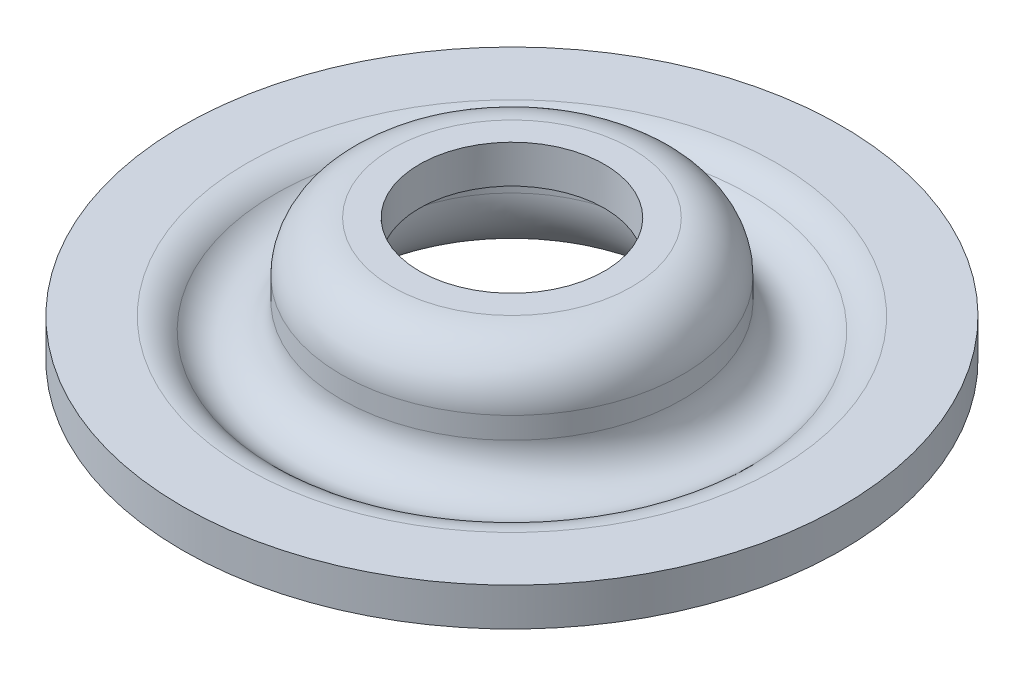
ISO-10303-21;
HEADER;
FILE_DESCRIPTION(('STEP AP214'),'2;1');
FILE_NAME('part.step','',(''),(''),'','','');
FILE_SCHEMA(('AUTOMOTIVE_DESIGN { 1 0 10303 214 1 1 1 1 }'));
ENDSEC;
DATA;
#1=APPLICATION_CONTEXT('core data for automotive mechanical design processes');
#2=APPLICATION_PROTOCOL_DEFINITION('international standard','automotive_design',2000,#1);
#3=PRODUCT_CONTEXT('',#1,'mechanical');
#4=PRODUCT('Part','Part','',(#3));
#5=PRODUCT_RELATED_PRODUCT_CATEGORY('part','',(#4));
#6=PRODUCT_DEFINITION_FORMATION('','',#4);
#7=PRODUCT_DEFINITION_CONTEXT('part definition',#1,'design');
#8=PRODUCT_DEFINITION('design','',#6,#7);
#9=PRODUCT_DEFINITION_SHAPE('','',#8);
#10=(LENGTH_UNIT() NAMED_UNIT(*) SI_UNIT(.MILLI.,.METRE.));
#11=(NAMED_UNIT(*) PLANE_ANGLE_UNIT() SI_UNIT($,.RADIAN.));
#12=(NAMED_UNIT(*) SI_UNIT($,.STERADIAN.) SOLID_ANGLE_UNIT());
#13=UNCERTAINTY_MEASURE_WITH_UNIT(LENGTH_MEASURE(1.E-05),#10,'distance_accuracy_value','');
#14=(GEOMETRIC_REPRESENTATION_CONTEXT(3) GLOBAL_UNCERTAINTY_ASSIGNED_CONTEXT((#13)) GLOBAL_UNIT_ASSIGNED_CONTEXT((#10,
#11,#12)) REPRESENTATION_CONTEXT('',''));
#15=CARTESIAN_POINT('',(0.,0.,0.));
#16=DIRECTION('',(0.,0.,1.));
#17=DIRECTION('',(1.,0.,0.));
#18=AXIS2_PLACEMENT_3D('',#15,#16,#17);
#19=CARTESIAN_POINT('',(0.,55.,0.));
#20=DIRECTION('',(0.,1.,0.));
#21=DIRECTION('',(0.,0.,1.));
#22=AXIS2_PLACEMENT_3D('',#19,#20,#21);
#23=CYLINDRICAL_SURFACE('',#22,26.);
#24=CARTESIAN_POINT('',(0.,1.978,0.));
#25=DIRECTION('',(0.,1.,0.));
#26=DIRECTION('',(0.,0.,1.));
#27=AXIS2_PLACEMENT_3D('',#24,#25,#26);
#28=CIRCLE('',#27,26.);
#29=CARTESIAN_POINT('',(0.,1.978,26.));
#30=VERTEX_POINT('',#29);
#31=EDGE_CURVE('E43',#30,#30,#28,.T.);
#32=ORIENTED_EDGE('',*,*,#31,.T.);
#33=EDGE_LOOP('',(#32));
#34=FACE_BOUND('',#33,.T.);
#35=CARTESIAN_POINT('',(0.,4.978,0.));
#36=DIRECTION('',(0.,1.,0.));
#37=DIRECTION('',(0.,0.,1.));
#38=AXIS2_PLACEMENT_3D('',#35,#36,#37);
#39=CIRCLE('',#38,26.);
#40=CARTESIAN_POINT('',(0.,4.978,26.));
#41=VERTEX_POINT('',#40);
#42=EDGE_CURVE('E70',#41,#41,#39,.T.);
#43=ORIENTED_EDGE('',*,*,#42,.F.);
#44=EDGE_LOOP('',(#43));
#45=FACE_BOUND('',#44,.T.);
#46=ADVANCED_FACE('F32',(#34,#45),#23,.T.);
#47=CARTESIAN_POINT('',(-26.,1.978,0.));
#48=DIRECTION('',(0.,-1.,0.));
#49=DIRECTION('',(0.,0.,-1.));
#50=AXIS2_PLACEMENT_3D('',#47,#48,#49);
#51=PLANE('',#50);
#52=CARTESIAN_POINT('',(0.,1.978,0.));
#53=DIRECTION('',(0.,1.,0.));
#54=DIRECTION('',(0.,0.,1.));
#55=AXIS2_PLACEMENT_3D('',#52,#53,#54);
#56=CIRCLE('',#55,20.9023607221338);
#57=CARTESIAN_POINT('',(0.,1.978,20.9023607221338));
#58=VERTEX_POINT('',#57);
#59=EDGE_CURVE('E47',#58,#58,#56,.T.);
#60=ORIENTED_EDGE('',*,*,#59,.T.);
#61=EDGE_LOOP('',(#60));
#62=FACE_BOUND('',#61,.T.);
#63=ORIENTED_EDGE('',*,*,#31,.F.);
#64=EDGE_LOOP('',(#63));
#65=FACE_BOUND('',#64,.T.);
#66=ADVANCED_FACE('F101',(#62,#65),#51,.T.);
#67=CARTESIAN_POINT('',(0.,6.,0.));
#68=DIRECTION('',(0.,1.,0.));
#69=DIRECTION('',(0.,0.,1.));
#70=AXIS2_PLACEMENT_3D('',#67,#68,#69);
#71=TOROIDAL_SURFACE('',#70,16.45,6.);
#72=CARTESIAN_POINT('',(0.,6.,0.));
#73=DIRECTION('',(0.,1.,0.));
#74=DIRECTION('',(0.,0.,1.));
#75=AXIS2_PLACEMENT_3D('',#72,#73,#74);
#76=CIRCLE('',#75,10.45);
#77=CARTESIAN_POINT('',(0.,6.,10.45));
#78=VERTEX_POINT('',#77);
#79=EDGE_CURVE('E52',#78,#78,#76,.T.);
#80=ORIENTED_EDGE('',*,*,#79,.T.);
#81=EDGE_LOOP('',(#80));
#82=FACE_BOUND('',#81,.T.);
#83=ORIENTED_EDGE('',*,*,#59,.F.);
#84=EDGE_LOOP('',(#83));
#85=FACE_BOUND('',#84,.T.);
#86=ADVANCED_FACE('F106',(#82,#85),#71,.T.);
#87=CARTESIAN_POINT('',(0.,55.,0.));
#88=DIRECTION('',(0.,1.,0.));
#89=DIRECTION('',(0.,0.,1.));
#90=AXIS2_PLACEMENT_3D('',#87,#88,#89);
#91=CYLINDRICAL_SURFACE('',#90,10.45);
#92=CARTESIAN_POINT('',(0.,7.698,0.));
#93=DIRECTION('',(0.,1.,0.));
#94=DIRECTION('',(0.,0.,1.));
#95=AXIS2_PLACEMENT_3D('',#92,#93,#94);
#96=CIRCLE('',#95,10.45);
#97=CARTESIAN_POINT('',(0.,7.698,10.45));
#98=VERTEX_POINT('',#97);
#99=EDGE_CURVE('E55',#98,#98,#96,.T.);
#100=ORIENTED_EDGE('',*,*,#99,.T.);
#101=EDGE_LOOP('',(#100));
#102=FACE_BOUND('',#101,.T.);
#103=ORIENTED_EDGE('',*,*,#79,.F.);
#104=EDGE_LOOP('',(#103));
#105=FACE_BOUND('',#104,.T.);
#106=ADVANCED_FACE('F113',(#102,#105),#91,.F.);
#107=CARTESIAN_POINT('',(0.,7.698,0.));
#108=DIRECTION('',(0.,1.,0.));
#109=DIRECTION('',(0.,0.,1.));
#110=AXIS2_PLACEMENT_3D('',#107,#108,#109);
#111=TOROIDAL_SURFACE('',#110,9.45,1.);
#112=CARTESIAN_POINT('',(0.,8.698,0.));
#113=DIRECTION('',(0.,1.,0.));
#114=DIRECTION('',(0.,0.,1.));
#115=AXIS2_PLACEMENT_3D('',#112,#113,#114);
#116=CIRCLE('',#115,9.45);
#117=CARTESIAN_POINT('',(0.,8.698,9.45));
#118=VERTEX_POINT('',#117);
#119=EDGE_CURVE('E58',#118,#118,#116,.T.);
#120=ORIENTED_EDGE('',*,*,#119,.T.);
#121=EDGE_LOOP('',(#120));
#122=FACE_BOUND('',#121,.T.);
#123=ORIENTED_EDGE('',*,*,#99,.F.);
#124=EDGE_LOOP('',(#123));
#125=FACE_BOUND('',#124,.T.);
#126=ADVANCED_FACE('F117',(#122,#125),#111,.F.);
#127=CARTESIAN_POINT('',(-9.45,8.698,0.));
#128=DIRECTION('',(0.,-1.,0.));
#129=DIRECTION('',(0.,0.,-1.));
#130=AXIS2_PLACEMENT_3D('',#127,#128,#129);
#131=PLANE('',#130);
#132=CARTESIAN_POINT('',(0.,8.698,0.));
#133=DIRECTION('',(0.,-1.,0.));
#134=DIRECTION('',(0.,0.,-1.));
#135=AXIS2_PLACEMENT_3D('',#132,#133,#134);
#136=CIRCLE('',#135,7.3);
#137=CARTESIAN_POINT('',(0.,8.698,-7.3));
#138=VERTEX_POINT('',#137);
#139=EDGE_CURVE('E73',#138,#138,#136,.T.);
#140=ORIENTED_EDGE('',*,*,#139,.F.);
#141=EDGE_LOOP('',(#140));
#142=FACE_BOUND('',#141,.T.);
#143=ORIENTED_EDGE('',*,*,#119,.F.);
#144=EDGE_LOOP('',(#143));
#145=FACE_BOUND('',#144,.T.);
#146=ADVANCED_FACE('F86',(#142,#145),#131,.T.);
#147=CARTESIAN_POINT('',(-9.45,11.698,0.));
#148=DIRECTION('',(0.,1.,0.));
#149=DIRECTION('',(0.,0.,1.));
#150=AXIS2_PLACEMENT_3D('',#147,#148,#149);
#151=PLANE('',#150);
#152=CARTESIAN_POINT('',(0.,11.698,0.));
#153=DIRECTION('',(0.,1.,0.));
#154=DIRECTION('',(0.,0.,1.));
#155=AXIS2_PLACEMENT_3D('',#152,#153,#154);
#156=CIRCLE('',#155,7.3);
#157=CARTESIAN_POINT('',(0.,11.698,7.3));
#158=VERTEX_POINT('',#157);
#159=EDGE_CURVE('E76',#158,#158,#156,.T.);
#160=ORIENTED_EDGE('',*,*,#159,.F.);
#161=EDGE_LOOP('',(#160));
#162=FACE_BOUND('',#161,.T.);
#163=CARTESIAN_POINT('',(0.,11.698,0.));
#164=DIRECTION('',(0.,1.,0.));
#165=DIRECTION('',(0.,0.,1.));
#166=AXIS2_PLACEMENT_3D('',#163,#164,#165);
#167=CIRCLE('',#166,9.45);
#168=CARTESIAN_POINT('',(0.,11.698,9.45));
#169=VERTEX_POINT('',#168);
#170=EDGE_CURVE('E61',#169,#169,#167,.T.);
#171=ORIENTED_EDGE('',*,*,#170,.T.);
#172=EDGE_LOOP('',(#171));
#173=FACE_BOUND('',#172,.T.);
#174=ADVANCED_FACE('F82',(#162,#173),#151,.T.);
#175=CARTESIAN_POINT('',(0.,7.698,0.));
#176=DIRECTION('',(0.,1.,0.));
#177=DIRECTION('',(0.,0.,1.));
#178=AXIS2_PLACEMENT_3D('',#175,#176,#177);
#179=TOROIDAL_SURFACE('',#178,9.45,4.);
#180=CARTESIAN_POINT('',(0.,7.698,0.));
#181=DIRECTION('',(0.,1.,0.));
#182=DIRECTION('',(0.,0.,1.));
#183=AXIS2_PLACEMENT_3D('',#180,#181,#182);
#184=CIRCLE('',#183,13.45);
#185=CARTESIAN_POINT('',(0.,7.698,13.45));
#186=VERTEX_POINT('',#185);
#187=EDGE_CURVE('E64',#186,#186,#184,.T.);
#188=ORIENTED_EDGE('',*,*,#187,.T.);
#189=EDGE_LOOP('',(#188));
#190=FACE_BOUND('',#189,.T.);
#191=ORIENTED_EDGE('',*,*,#170,.F.);
#192=EDGE_LOOP('',(#191));
#193=FACE_BOUND('',#192,.T.);
#194=ADVANCED_FACE('F85',(#190,#193),#179,.T.);
#195=CARTESIAN_POINT('',(0.,55.,0.));
#196=DIRECTION('',(0.,1.,0.));
#197=DIRECTION('',(0.,0.,1.));
#198=AXIS2_PLACEMENT_3D('',#195,#196,#197);
#199=CYLINDRICAL_SURFACE('',#198,13.45);
#200=CARTESIAN_POINT('',(0.,6.,0.));
#201=DIRECTION('',(0.,1.,0.));
#202=DIRECTION('',(0.,0.,1.));
#203=AXIS2_PLACEMENT_3D('',#200,#201,#202);
#204=CIRCLE('',#203,13.45);
#205=CARTESIAN_POINT('',(0.,6.,13.45));
#206=VERTEX_POINT('',#205);
#207=EDGE_CURVE('E67',#206,#206,#204,.T.);
#208=ORIENTED_EDGE('',*,*,#207,.T.);
#209=EDGE_LOOP('',(#208));
#210=FACE_BOUND('',#209,.T.);
#211=ORIENTED_EDGE('',*,*,#187,.F.);
#212=EDGE_LOOP('',(#211));
#213=FACE_BOUND('',#212,.T.);
#214=ADVANCED_FACE('F91',(#210,#213),#199,.T.);
#215=CARTESIAN_POINT('',(0.,6.,0.));
#216=DIRECTION('',(0.,1.,0.));
#217=DIRECTION('',(0.,0.,1.));
#218=AXIS2_PLACEMENT_3D('',#215,#216,#217);
#219=TOROIDAL_SURFACE('',#218,16.45,3.);
#220=CARTESIAN_POINT('',(0.,3.98900000000002,0.));
#221=DIRECTION('',(0.,1.,0.));
#222=DIRECTION('',(0.,0.,1.));
#223=AXIS2_PLACEMENT_3D('',#220,#221,#222);
#224=CIRCLE('',#223,18.6761803610669);
#225=CARTESIAN_POINT('',(0.,3.98900000000002,18.6761803610669));
#226=VERTEX_POINT('',#225);
#227=EDGE_CURVE('E39',#226,#226,#224,.T.);
#228=ORIENTED_EDGE('',*,*,#227,.T.);
#229=EDGE_LOOP('',(#228));
#230=FACE_BOUND('',#229,.T.);
#231=ORIENTED_EDGE('',*,*,#207,.F.);
#232=EDGE_LOOP('',(#231));
#233=FACE_BOUND('',#232,.T.);
#234=ADVANCED_FACE('F97',(#230,#233),#219,.F.);
#235=CARTESIAN_POINT('',(-26.,4.978,0.));
#236=DIRECTION('',(0.,1.,0.));
#237=DIRECTION('',(0.,0.,1.));
#238=AXIS2_PLACEMENT_3D('',#235,#236,#237);
#239=PLANE('',#238);
#240=CARTESIAN_POINT('',(0.,4.978,0.));
#241=DIRECTION('',(0.,1.,0.));
#242=DIRECTION('',(0.,0.,1.));
#243=AXIS2_PLACEMENT_3D('',#240,#241,#242);
#244=CIRCLE('',#243,20.9023607221338);
#245=CARTESIAN_POINT('',(0.,4.978,20.9023607221338));
#246=VERTEX_POINT('',#245);
#247=EDGE_CURVE('E10',#246,#246,#244,.F.);
#248=ORIENTED_EDGE('',*,*,#247,.T.);
#249=EDGE_LOOP('',(#248));
#250=FACE_BOUND('',#249,.T.);
#251=ORIENTED_EDGE('',*,*,#42,.T.);
#252=EDGE_LOOP('',(#251));
#253=FACE_BOUND('',#252,.T.);
#254=ADVANCED_FACE('F143',(#250,#253),#239,.T.);
#255=CARTESIAN_POINT('',(0.,1.978,0.));
#256=DIRECTION('',(0.,1.,0.));
#257=DIRECTION('',(0.,0.,1.));
#258=AXIS2_PLACEMENT_3D('',#255,#256,#257);
#259=TOROIDAL_SURFACE('',#258,20.9023607221338,3.);
#260=ORIENTED_EDGE('',*,*,#247,.F.);
#261=EDGE_LOOP('',(#260));
#262=FACE_BOUND('',#261,.T.);
#263=ORIENTED_EDGE('',*,*,#227,.F.);
#264=EDGE_LOOP('',(#263));
#265=FACE_BOUND('',#264,.T.);
#266=ADVANCED_FACE('F34',(#262,#265),#259,.T.);
#267=CARTESIAN_POINT('',(0.,0.,0.));
#268=DIRECTION('',(0.,1.,0.));
#269=DIRECTION('',(0.,0.,1.));
#270=AXIS2_PLACEMENT_3D('',#267,#268,#269);
#271=CYLINDRICAL_SURFACE('',#270,7.3);
#272=ORIENTED_EDGE('',*,*,#139,.T.);
#273=EDGE_LOOP('',(#272));
#274=FACE_BOUND('',#273,.T.);
#275=ORIENTED_EDGE('',*,*,#159,.T.);
#276=EDGE_LOOP('',(#275));
#277=FACE_BOUND('',#276,.T.);
#278=ADVANCED_FACE('F80',(#274,#277),#271,.F.);
#279=CLOSED_SHELL('',(#46,#66,#86,#106,#126,#146,#174,#194,#214,#234,#254,#266,#278));
#280=MANIFOLD_SOLID_BREP('B2',#279);
#281=ADVANCED_BREP_SHAPE_REPRESENTATION('',(#18,#280),#14);
#282=SHAPE_DEFINITION_REPRESENTATION(#9,#281);
ENDSEC;
END-ISO-10303-21;
